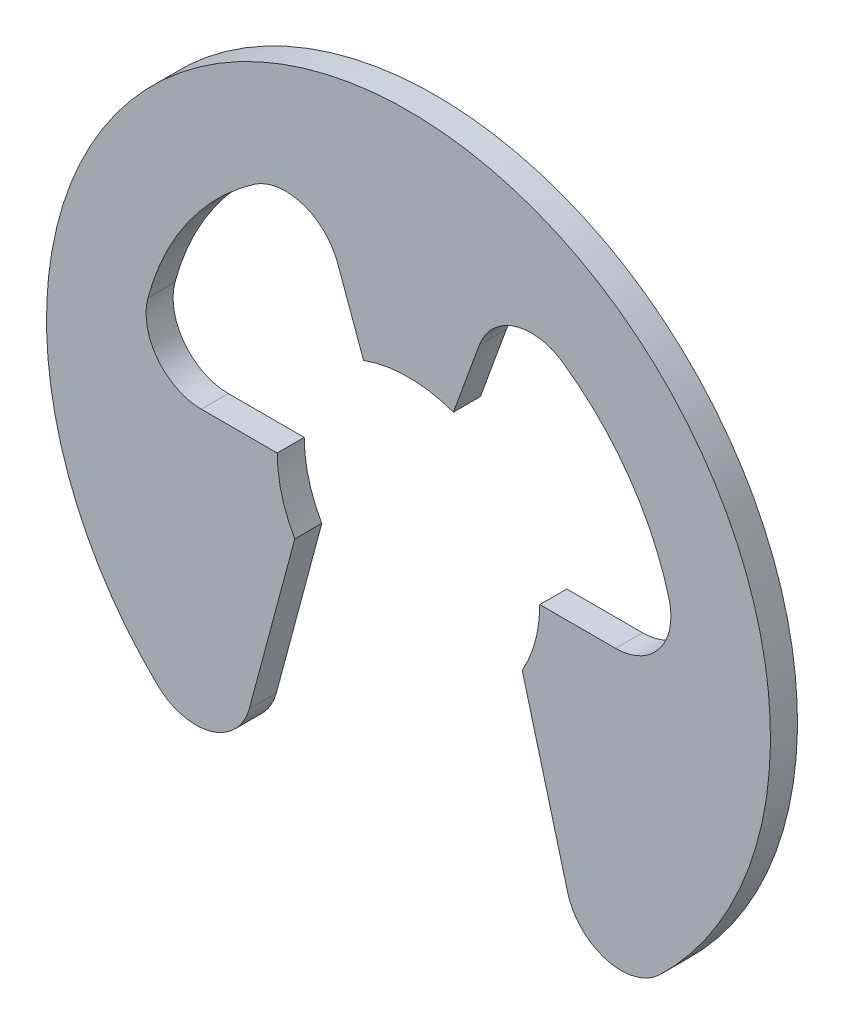
ISO-10303-21;
HEADER;
FILE_DESCRIPTION(('STEP AP214'),'2;1');
FILE_NAME('part.step','',(''),(''),'','','');
FILE_SCHEMA(('AUTOMOTIVE_DESIGN { 1 0 10303 214 1 1 1 1 }'));
ENDSEC;
DATA;
#1=APPLICATION_CONTEXT('core data for automotive mechanical design processes');
#2=APPLICATION_PROTOCOL_DEFINITION('international standard','automotive_design',2000,#1);
#3=PRODUCT_CONTEXT('',#1,'mechanical');
#4=PRODUCT('Part','Part','',(#3));
#5=PRODUCT_RELATED_PRODUCT_CATEGORY('part','',(#4));
#6=PRODUCT_DEFINITION_FORMATION('','',#4);
#7=PRODUCT_DEFINITION_CONTEXT('part definition',#1,'design');
#8=PRODUCT_DEFINITION('design','',#6,#7);
#9=PRODUCT_DEFINITION_SHAPE('','',#8);
#10=(LENGTH_UNIT() NAMED_UNIT(*) SI_UNIT(.MILLI.,.METRE.));
#11=(NAMED_UNIT(*) PLANE_ANGLE_UNIT() SI_UNIT($,.RADIAN.));
#12=(NAMED_UNIT(*) SI_UNIT($,.STERADIAN.) SOLID_ANGLE_UNIT());
#13=UNCERTAINTY_MEASURE_WITH_UNIT(LENGTH_MEASURE(1.E-05),#10,'distance_accuracy_value','');
#14=(GEOMETRIC_REPRESENTATION_CONTEXT(3) GLOBAL_UNCERTAINTY_ASSIGNED_CONTEXT((#13)) GLOBAL_UNIT_ASSIGNED_CONTEXT((#10,
#11,#12)) REPRESENTATION_CONTEXT('',''));
#15=CARTESIAN_POINT('',(0.,0.,0.));
#16=DIRECTION('',(0.,0.,1.));
#17=DIRECTION('',(1.,0.,0.));
#18=AXIS2_PLACEMENT_3D('',#15,#16,#17);
#19=CARTESIAN_POINT('',(0.,0.,0.));
#20=DIRECTION('',(0.,0.,1.));
#21=DIRECTION('',(1.,0.,0.));
#22=AXIS2_PLACEMENT_3D('',#19,#20,#21);
#23=PLANE('',#22);
#24=CARTESIAN_POINT('',(4.86734202869698,1.301496,0.));
#25=DIRECTION('',(0.,0.,1.));
#26=DIRECTION('',(1.,0.,0.));
#27=AXIS2_PLACEMENT_3D('',#24,#25,#26);
#28=CIRCLE('',#27,1.301496);
#29=CARTESIAN_POINT('',(6.12466510568041,1.63769611615245,0.));
#30=VERTEX_POINT('',#29);
#31=CARTESIAN_POINT('',(4.86734202869698,0.,0.));
#32=VERTEX_POINT('',#31);
#33=EDGE_CURVE('E164',#30,#32,#28,.F.);
#34=ORIENTED_EDGE('',*,*,#33,.T.);
#35=DIRECTION('',(-1.,0.,0.));
#36=VECTOR('',#35,1.);
#37=CARTESIAN_POINT('',(3.0861,0.,0.));
#38=LINE('',#37,#36);
#39=CARTESIAN_POINT('',(3.0861,0.,0.));
#40=VERTEX_POINT('',#39);
#41=EDGE_CURVE('E142',#40,#32,#38,.F.);
#42=ORIENTED_EDGE('',*,*,#41,.F.);
#43=CARTESIAN_POINT('',(0.,0.,0.));
#44=DIRECTION('',(0.,0.,1.));
#45=DIRECTION('',(1.,0.,0.));
#46=AXIS2_PLACEMENT_3D('',#43,#44,#45);
#47=CIRCLE('',#46,3.0861);
#48=CARTESIAN_POINT('',(2.67264099861915,-1.54305,0.));
#49=VERTEX_POINT('',#48);
#50=EDGE_CURVE('E17',#40,#49,#47,.F.);
#51=ORIENTED_EDGE('',*,*,#50,.T.);
#52=DIRECTION('',(0.258819045102523,-0.965925826289068,0.));
#53=VECTOR('',#52,1.);
#54=CARTESIAN_POINT('',(2.67264099861915,-1.54305,0.));
#55=LINE('',#54,#53);
#56=CARTESIAN_POINT('',(3.74090877619442,-5.52987962199954,0.));
#57=VERTEX_POINT('',#56);
#58=EDGE_CURVE('E140',#57,#49,#55,.F.);
#59=ORIENTED_EDGE('',*,*,#58,.F.);
#60=CARTESIAN_POINT('',(4.99805737540633,-5.19302767007479,0.));
#61=DIRECTION('',(0.,0.,1.));
#62=DIRECTION('',(1.,0.,0.));
#63=AXIS2_PLACEMENT_3D('',#60,#61,#62);
#64=CIRCLE('',#63,1.301496);
#65=CARTESIAN_POINT('',(5.90058225529011,-6.13075933702796,0.));
#66=VERTEX_POINT('',#65);
#67=EDGE_CURVE('E149',#66,#57,#64,.F.);
#68=ORIENTED_EDGE('',*,*,#67,.F.);
#69=CARTESIAN_POINT('',(0.,0.,0.));
#70=DIRECTION('',(0.,0.,1.));
#71=DIRECTION('',(1.,0.,0.));
#72=AXIS2_PLACEMENT_3D('',#69,#70,#71);
#73=CIRCLE('',#72,8.509);
#74=CARTESIAN_POINT('',(-5.90058225529011,-6.13075933702796,0.));
#75=VERTEX_POINT('',#74);
#76=EDGE_CURVE('E211',#75,#66,#73,.F.);
#77=ORIENTED_EDGE('',*,*,#76,.F.);
#78=CARTESIAN_POINT('',(-4.99805737540633,-5.19302767007479,0.));
#79=DIRECTION('',(0.,0.,1.));
#80=DIRECTION('',(1.,0.,0.));
#81=AXIS2_PLACEMENT_3D('',#78,#79,#80);
#82=CIRCLE('',#81,1.301496);
#83=CARTESIAN_POINT('',(-3.74090877619442,-5.52987962199954,0.));
#84=VERTEX_POINT('',#83);
#85=EDGE_CURVE('E208',#84,#75,#82,.F.);
#86=ORIENTED_EDGE('',*,*,#85,.F.);
#87=DIRECTION('',(0.258819045102522,0.965925826289068,0.));
#88=VECTOR('',#87,1.);
#89=CARTESIAN_POINT('',(-2.67264099861915,-1.54305,0.));
#90=LINE('',#89,#88);
#91=CARTESIAN_POINT('',(-2.67264099861915,-1.54305,0.));
#92=VERTEX_POINT('',#91);
#93=EDGE_CURVE('E204',#92,#84,#90,.F.);
#94=ORIENTED_EDGE('',*,*,#93,.F.);
#95=CARTESIAN_POINT('',(0.,0.,0.));
#96=DIRECTION('',(0.,0.,1.));
#97=DIRECTION('',(1.,0.,0.));
#98=AXIS2_PLACEMENT_3D('',#95,#96,#97);
#99=CIRCLE('',#98,3.0861);
#100=CARTESIAN_POINT('',(-3.0861,0.,0.));
#101=VERTEX_POINT('',#100);
#102=EDGE_CURVE('E201',#92,#101,#99,.F.);
#103=ORIENTED_EDGE('',*,*,#102,.T.);
#104=DIRECTION('',(-1.,0.,0.));
#105=VECTOR('',#104,1.);
#106=CARTESIAN_POINT('',(-3.0861,0.,0.));
#107=LINE('',#106,#105);
#108=CARTESIAN_POINT('',(-4.86734202869698,0.,0.));
#109=VERTEX_POINT('',#108);
#110=EDGE_CURVE('E197',#109,#101,#107,.F.);
#111=ORIENTED_EDGE('',*,*,#110,.F.);
#112=CARTESIAN_POINT('',(-4.86734202869698,1.301496,0.));
#113=DIRECTION('',(0.,0.,1.));
#114=DIRECTION('',(1.,0.,0.));
#115=AXIS2_PLACEMENT_3D('',#112,#113,#114);
#116=CIRCLE('',#115,1.301496);
#117=CARTESIAN_POINT('',(-6.12466510568041,1.63769611615245,0.));
#118=VERTEX_POINT('',#117);
#119=EDGE_CURVE('E191',#109,#118,#116,.F.);
#120=ORIENTED_EDGE('',*,*,#119,.T.);
#121=CARTESIAN_POINT('',(0.,0.,0.));
#122=DIRECTION('',(0.,0.,1.));
#123=DIRECTION('',(1.,0.,0.));
#124=AXIS2_PLACEMENT_3D('',#121,#122,#123);
#125=CIRCLE('',#124,6.33984);
#126=CARTESIAN_POINT('',(-3.63368979270474,5.19517754422247,0.));
#127=VERTEX_POINT('',#126);
#128=EDGE_CURVE('E187',#118,#127,#125,.F.);
#129=ORIENTED_EDGE('',*,*,#128,.T.);
#130=CARTESIAN_POINT('',(-2.88773520545237,4.12866753874987,0.));
#131=DIRECTION('',(0.,0.,1.));
#132=DIRECTION('',(1.,0.,0.));
#133=AXIS2_PLACEMENT_3D('',#130,#131,#132);
#134=CIRCLE('',#133,1.301496);
#135=CARTESIAN_POINT('',(-1.66472901827,4.57380538720766,0.));
#136=VERTEX_POINT('',#135);
#137=EDGE_CURVE('E186',#127,#136,#134,.F.);
#138=ORIENTED_EDGE('',*,*,#137,.T.);
#139=DIRECTION('',(0.34202014332567,-0.939692620785908,0.));
#140=VECTOR('',#139,1.);
#141=CARTESIAN_POINT('',(-1.05550836431735,2.89998539700739,0.));
#142=LINE('',#141,#140);
#143=CARTESIAN_POINT('',(-1.05550836431735,2.89998539700739,0.));
#144=VERTEX_POINT('',#143);
#145=EDGE_CURVE('E182',#144,#136,#142,.F.);
#146=ORIENTED_EDGE('',*,*,#145,.F.);
#147=CARTESIAN_POINT('',(0.,0.,0.));
#148=DIRECTION('',(0.,0.,1.));
#149=DIRECTION('',(1.,0.,0.));
#150=AXIS2_PLACEMENT_3D('',#147,#148,#149);
#151=CIRCLE('',#150,3.0861);
#152=CARTESIAN_POINT('',(1.05550836431735,2.89998539700739,0.));
#153=VERTEX_POINT('',#152);
#154=EDGE_CURVE('E179',#144,#153,#151,.F.);
#155=ORIENTED_EDGE('',*,*,#154,.T.);
#156=DIRECTION('',(0.34202014332567,0.939692620785908,0.));
#157=VECTOR('',#156,1.);
#158=CARTESIAN_POINT('',(1.05550836431735,2.89998539700739,0.));
#159=LINE('',#158,#157);
#160=CARTESIAN_POINT('',(1.66472901827,4.57380538720766,0.));
#161=VERTEX_POINT('',#160);
#162=EDGE_CURVE('E175',#161,#153,#159,.F.);
#163=ORIENTED_EDGE('',*,*,#162,.F.);
#164=CARTESIAN_POINT('',(2.88773520545237,4.12866753874987,0.));
#165=DIRECTION('',(0.,0.,1.));
#166=DIRECTION('',(1.,0.,0.));
#167=AXIS2_PLACEMENT_3D('',#164,#165,#166);
#168=CIRCLE('',#167,1.301496);
#169=CARTESIAN_POINT('',(3.63368979270474,5.19517754422247,0.));
#170=VERTEX_POINT('',#169);
#171=EDGE_CURVE('E169',#161,#170,#168,.F.);
#172=ORIENTED_EDGE('',*,*,#171,.T.);
#173=CARTESIAN_POINT('',(0.,0.,0.));
#174=DIRECTION('',(0.,0.,1.));
#175=DIRECTION('',(1.,0.,0.));
#176=AXIS2_PLACEMENT_3D('',#173,#174,#175);
#177=CIRCLE('',#176,6.33984);
#178=EDGE_CURVE('E165',#170,#30,#177,.F.);
#179=ORIENTED_EDGE('',*,*,#178,.T.);
#180=EDGE_LOOP('',(#34,#42,#51,#59,#68,#77,#86,#94,#103,#111,#120,#129,#138,#146,#155,#163,#172,#179));
#181=FACE_BOUND('',#180,.T.);
#182=ADVANCED_FACE('F14',(#181),#23,.T.);
#183=CARTESIAN_POINT('',(2.67264099861915,-1.54305,-0.635));
#184=DIRECTION('',(-0.965925826289068,-0.258819045102523,0.));
#185=DIRECTION('',(0.258819045102523,-0.965925826289068,0.));
#186=AXIS2_PLACEMENT_3D('',#183,#184,#185);
#187=PLANE('',#186);
#188=DIRECTION('',(0.258819045102522,-0.965925826289068,0.));
#189=VECTOR('',#188,1.);
#190=CARTESIAN_POINT('',(2.67264099861915,-1.54305,-0.635));
#191=LINE('',#190,#189);
#192=CARTESIAN_POINT('',(2.67264099861915,-1.54305,-0.635));
#193=VERTEX_POINT('',#192);
#194=CARTESIAN_POINT('',(3.74090877619442,-5.52987962199954,-0.635));
#195=VERTEX_POINT('',#194);
#196=EDGE_CURVE('E154',#193,#195,#191,.T.);
#197=ORIENTED_EDGE('',*,*,#196,.T.);
#198=DIRECTION('',(0.,0.,1.));
#199=VECTOR('',#198,1.);
#200=CARTESIAN_POINT('',(3.74090877619442,-5.52987962199954,-0.635));
#201=LINE('',#200,#199);
#202=EDGE_CURVE('E148',#57,#195,#201,.F.);
#203=ORIENTED_EDGE('',*,*,#202,.F.);
#204=ORIENTED_EDGE('',*,*,#58,.T.);
#205=DIRECTION('',(0.,0.,1.));
#206=VECTOR('',#205,1.);
#207=CARTESIAN_POINT('',(2.67264099861915,-1.54305,-0.635));
#208=LINE('',#207,#206);
#209=EDGE_CURVE('E147',#49,#193,#208,.F.);
#210=ORIENTED_EDGE('',*,*,#209,.T.);
#211=EDGE_LOOP('',(#197,#203,#204,#210));
#212=FACE_BOUND('',#211,.T.);
#213=ADVANCED_FACE('F146',(#212),#187,.T.);
#214=CARTESIAN_POINT('',(4.99805737540633,-5.19302767007479,-0.635));
#215=DIRECTION('',(0.,0.,1.));
#216=DIRECTION('',(1.,0.,0.));
#217=AXIS2_PLACEMENT_3D('',#214,#215,#216);
#218=CYLINDRICAL_SURFACE('',#217,1.301496);
#219=CARTESIAN_POINT('',(4.99805737540633,-5.19302767007479,-0.635));
#220=DIRECTION('',(0.,0.,1.));
#221=DIRECTION('',(1.,0.,0.));
#222=AXIS2_PLACEMENT_3D('',#219,#220,#221);
#223=CIRCLE('',#222,1.301496);
#224=CARTESIAN_POINT('',(5.90058225529011,-6.13075933702796,-0.635));
#225=VERTEX_POINT('',#224);
#226=EDGE_CURVE('E250',#195,#225,#223,.T.);
#227=ORIENTED_EDGE('',*,*,#226,.T.);
#228=DIRECTION('',(0.,0.,1.));
#229=VECTOR('',#228,1.);
#230=CARTESIAN_POINT('',(5.90058225529011,-6.13075933702796,-0.635));
#231=LINE('',#230,#229);
#232=EDGE_CURVE('E209',#66,#225,#231,.F.);
#233=ORIENTED_EDGE('',*,*,#232,.F.);
#234=ORIENTED_EDGE('',*,*,#67,.T.);
#235=ORIENTED_EDGE('',*,*,#202,.T.);
#236=EDGE_LOOP('',(#227,#233,#234,#235));
#237=FACE_BOUND('',#236,.T.);
#238=ADVANCED_FACE('F268',(#237),#218,.T.);
#239=CARTESIAN_POINT('',(0.,0.,-0.635));
#240=DIRECTION('',(0.,0.,1.));
#241=DIRECTION('',(1.,0.,0.));
#242=AXIS2_PLACEMENT_3D('',#239,#240,#241);
#243=CYLINDRICAL_SURFACE('',#242,8.509);
#244=DIRECTION('',(0.,0.,1.));
#245=VECTOR('',#244,1.);
#246=CARTESIAN_POINT('',(-5.90058225529011,-6.13075933702796,-0.635));
#247=LINE('',#246,#245);
#248=CARTESIAN_POINT('',(-5.90058225529011,-6.13075933702796,-0.635));
#249=VERTEX_POINT('',#248);
#250=EDGE_CURVE('E205',#75,#249,#247,.F.);
#251=ORIENTED_EDGE('',*,*,#250,.F.);
#252=ORIENTED_EDGE('',*,*,#76,.T.);
#253=ORIENTED_EDGE('',*,*,#232,.T.);
#254=CARTESIAN_POINT('',(0.,0.,-0.635));
#255=DIRECTION('',(0.,0.,1.));
#256=DIRECTION('',(1.,0.,0.));
#257=AXIS2_PLACEMENT_3D('',#254,#255,#256);
#258=CIRCLE('',#257,8.509);
#259=EDGE_CURVE('E248',#225,#249,#258,.T.);
#260=ORIENTED_EDGE('',*,*,#259,.T.);
#261=EDGE_LOOP('',(#251,#252,#253,#260));
#262=FACE_BOUND('',#261,.T.);
#263=ADVANCED_FACE('F275',(#262),#243,.T.);
#264=CARTESIAN_POINT('',(-4.99805737540633,-5.19302767007479,-0.635));
#265=DIRECTION('',(0.,0.,1.));
#266=DIRECTION('',(1.,0.,0.));
#267=AXIS2_PLACEMENT_3D('',#264,#265,#266);
#268=CYLINDRICAL_SURFACE('',#267,1.301496);
#269=CARTESIAN_POINT('',(-4.99805737540633,-5.19302767007479,-0.635));
#270=DIRECTION('',(0.,0.,1.));
#271=DIRECTION('',(1.,0.,0.));
#272=AXIS2_PLACEMENT_3D('',#269,#270,#271);
#273=CIRCLE('',#272,1.301496);
#274=CARTESIAN_POINT('',(-3.74090877619442,-5.52987962199954,-0.635));
#275=VERTEX_POINT('',#274);
#276=EDGE_CURVE('E245',#249,#275,#273,.T.);
#277=ORIENTED_EDGE('',*,*,#276,.T.);
#278=DIRECTION('',(0.,0.,1.));
#279=VECTOR('',#278,1.);
#280=CARTESIAN_POINT('',(-3.74090877619442,-5.52987962199954,-0.635));
#281=LINE('',#280,#279);
#282=EDGE_CURVE('E202',#84,#275,#281,.F.);
#283=ORIENTED_EDGE('',*,*,#282,.F.);
#284=ORIENTED_EDGE('',*,*,#85,.T.);
#285=ORIENTED_EDGE('',*,*,#250,.T.);
#286=EDGE_LOOP('',(#277,#283,#284,#285));
#287=FACE_BOUND('',#286,.T.);
#288=ADVANCED_FACE('F279',(#287),#268,.T.);
#289=CARTESIAN_POINT('',(-2.67264099861915,-1.54305,-0.635));
#290=DIRECTION('',(0.965925826289068,-0.258819045102522,0.));
#291=DIRECTION('',(0.258819045102522,0.965925826289068,0.));
#292=AXIS2_PLACEMENT_3D('',#289,#290,#291);
#293=PLANE('',#292);
#294=DIRECTION('',(0.258819045102522,0.965925826289068,0.));
#295=VECTOR('',#294,1.);
#296=CARTESIAN_POINT('',(-3.74090877619442,-5.52987962199954,-0.635));
#297=LINE('',#296,#295);
#298=CARTESIAN_POINT('',(-2.67264099861915,-1.54305,-0.635));
#299=VERTEX_POINT('',#298);
#300=EDGE_CURVE('E244',#275,#299,#297,.T.);
#301=ORIENTED_EDGE('',*,*,#300,.T.);
#302=DIRECTION('',(0.,0.,1.));
#303=VECTOR('',#302,1.);
#304=CARTESIAN_POINT('',(-2.67264099861915,-1.54305,-0.635));
#305=LINE('',#304,#303);
#306=EDGE_CURVE('E198',#299,#92,#305,.T.);
#307=ORIENTED_EDGE('',*,*,#306,.T.);
#308=ORIENTED_EDGE('',*,*,#93,.T.);
#309=ORIENTED_EDGE('',*,*,#282,.T.);
#310=EDGE_LOOP('',(#301,#307,#308,#309));
#311=FACE_BOUND('',#310,.T.);
#312=ADVANCED_FACE('F339',(#311),#293,.T.);
#313=CARTESIAN_POINT('',(0.,0.,-0.635));
#314=DIRECTION('',(0.,0.,1.));
#315=DIRECTION('',(1.,0.,0.));
#316=AXIS2_PLACEMENT_3D('',#313,#314,#315);
#317=CYLINDRICAL_SURFACE('',#316,3.0861);
#318=ORIENTED_EDGE('',*,*,#306,.F.);
#319=CARTESIAN_POINT('',(0.,0.,-0.635));
#320=DIRECTION('',(0.,0.,1.));
#321=DIRECTION('',(1.,0.,0.));
#322=AXIS2_PLACEMENT_3D('',#319,#320,#321);
#323=CIRCLE('',#322,3.0861);
#324=CARTESIAN_POINT('',(-3.0861,0.,-0.635));
#325=VERTEX_POINT('',#324);
#326=EDGE_CURVE('E241',#299,#325,#323,.F.);
#327=ORIENTED_EDGE('',*,*,#326,.T.);
#328=DIRECTION('',(0.,0.,1.));
#329=VECTOR('',#328,1.);
#330=CARTESIAN_POINT('',(-3.0861,0.,-0.635));
#331=LINE('',#330,#329);
#332=EDGE_CURVE('E195',#101,#325,#331,.F.);
#333=ORIENTED_EDGE('',*,*,#332,.F.);
#334=ORIENTED_EDGE('',*,*,#102,.F.);
#335=EDGE_LOOP('',(#318,#327,#333,#334));
#336=FACE_BOUND('',#335,.T.);
#337=ADVANCED_FACE('F338',(#336),#317,.F.);
#338=CARTESIAN_POINT('',(-3.0861,0.,-0.635));
#339=DIRECTION('',(0.,1.,0.));
#340=DIRECTION('',(-1.,0.,0.));
#341=AXIS2_PLACEMENT_3D('',#338,#339,#340);
#342=PLANE('',#341);
#343=DIRECTION('',(1.,0.,0.));
#344=VECTOR('',#343,1.);
#345=CARTESIAN_POINT('',(0.,0.,-0.635));
#346=LINE('',#345,#344);
#347=CARTESIAN_POINT('',(-4.86734202869698,0.,-0.635));
#348=VERTEX_POINT('',#347);
#349=EDGE_CURVE('E240',#325,#348,#346,.F.);
#350=ORIENTED_EDGE('',*,*,#349,.T.);
#351=DIRECTION('',(0.,0.,1.));
#352=VECTOR('',#351,1.);
#353=CARTESIAN_POINT('',(-4.86734202869698,0.,-0.635));
#354=LINE('',#353,#352);
#355=EDGE_CURVE('E192',#348,#109,#354,.T.);
#356=ORIENTED_EDGE('',*,*,#355,.T.);
#357=ORIENTED_EDGE('',*,*,#110,.T.);
#358=ORIENTED_EDGE('',*,*,#332,.T.);
#359=EDGE_LOOP('',(#350,#356,#357,#358));
#360=FACE_BOUND('',#359,.T.);
#361=ADVANCED_FACE('F334',(#360),#342,.T.);
#362=CARTESIAN_POINT('',(-4.86734202869698,1.301496,-0.635));
#363=DIRECTION('',(0.,0.,1.));
#364=DIRECTION('',(1.,0.,0.));
#365=AXIS2_PLACEMENT_3D('',#362,#363,#364);
#366=CYLINDRICAL_SURFACE('',#365,1.301496);
#367=ORIENTED_EDGE('',*,*,#355,.F.);
#368=CARTESIAN_POINT('',(-4.86734202869698,1.301496,-0.635));
#369=DIRECTION('',(0.,0.,1.));
#370=DIRECTION('',(1.,0.,0.));
#371=AXIS2_PLACEMENT_3D('',#368,#369,#370);
#372=CIRCLE('',#371,1.301496);
#373=CARTESIAN_POINT('',(-6.12466510568041,1.63769611615245,-0.635));
#374=VERTEX_POINT('',#373);
#375=EDGE_CURVE('E237',#348,#374,#372,.F.);
#376=ORIENTED_EDGE('',*,*,#375,.T.);
#377=DIRECTION('',(0.,0.,1.));
#378=VECTOR('',#377,1.);
#379=CARTESIAN_POINT('',(-6.12466510568041,1.63769611615245,-0.635));
#380=LINE('',#379,#378);
#381=EDGE_CURVE('E188',#374,#118,#380,.T.);
#382=ORIENTED_EDGE('',*,*,#381,.T.);
#383=ORIENTED_EDGE('',*,*,#119,.F.);
#384=EDGE_LOOP('',(#367,#376,#382,#383));
#385=FACE_BOUND('',#384,.T.);
#386=ADVANCED_FACE('F332',(#385),#366,.F.);
#387=CARTESIAN_POINT('',(0.,0.,-0.635));
#388=DIRECTION('',(0.,0.,1.));
#389=DIRECTION('',(1.,0.,0.));
#390=AXIS2_PLACEMENT_3D('',#387,#388,#389);
#391=CYLINDRICAL_SURFACE('',#390,6.33984);
#392=ORIENTED_EDGE('',*,*,#381,.F.);
#393=CARTESIAN_POINT('',(0.,0.,-0.635));
#394=DIRECTION('',(0.,0.,1.));
#395=DIRECTION('',(1.,0.,0.));
#396=AXIS2_PLACEMENT_3D('',#393,#394,#395);
#397=CIRCLE('',#396,6.33984);
#398=CARTESIAN_POINT('',(-3.63368979270474,5.19517754422247,-0.635));
#399=VERTEX_POINT('',#398);
#400=EDGE_CURVE('E234',#374,#399,#397,.F.);
#401=ORIENTED_EDGE('',*,*,#400,.T.);
#402=DIRECTION('',(0.,0.,1.));
#403=VECTOR('',#402,1.);
#404=CARTESIAN_POINT('',(-3.63368979270474,5.19517754422247,-0.635));
#405=LINE('',#404,#403);
#406=EDGE_CURVE('E183',#399,#127,#405,.T.);
#407=ORIENTED_EDGE('',*,*,#406,.T.);
#408=ORIENTED_EDGE('',*,*,#128,.F.);
#409=EDGE_LOOP('',(#392,#401,#407,#408));
#410=FACE_BOUND('',#409,.T.);
#411=ADVANCED_FACE('F328',(#410),#391,.F.);
#412=CARTESIAN_POINT('',(-2.88773520545237,4.12866753874987,-0.635));
#413=DIRECTION('',(0.,0.,1.));
#414=DIRECTION('',(1.,0.,0.));
#415=AXIS2_PLACEMENT_3D('',#412,#413,#414);
#416=CYLINDRICAL_SURFACE('',#415,1.301496);
#417=ORIENTED_EDGE('',*,*,#406,.F.);
#418=CARTESIAN_POINT('',(-2.88773520545237,4.12866753874987,-0.635));
#419=DIRECTION('',(0.,0.,1.));
#420=DIRECTION('',(1.,0.,0.));
#421=AXIS2_PLACEMENT_3D('',#418,#419,#420);
#422=CIRCLE('',#421,1.301496);
#423=CARTESIAN_POINT('',(-1.66472901827,4.57380538720766,-0.635));
#424=VERTEX_POINT('',#423);
#425=EDGE_CURVE('E231',#399,#424,#422,.F.);
#426=ORIENTED_EDGE('',*,*,#425,.T.);
#427=DIRECTION('',(0.,0.,1.));
#428=VECTOR('',#427,1.);
#429=CARTESIAN_POINT('',(-1.66472901827,4.57380538720766,-0.635));
#430=LINE('',#429,#428);
#431=EDGE_CURVE('E180',#136,#424,#430,.F.);
#432=ORIENTED_EDGE('',*,*,#431,.F.);
#433=ORIENTED_EDGE('',*,*,#137,.F.);
#434=EDGE_LOOP('',(#417,#426,#432,#433));
#435=FACE_BOUND('',#434,.T.);
#436=ADVANCED_FACE('F324',(#435),#416,.F.);
#437=CARTESIAN_POINT('',(-1.05550836431735,2.89998539700739,-0.635));
#438=DIRECTION('',(-0.939692620785908,-0.34202014332567,0.));
#439=DIRECTION('',(0.34202014332567,-0.939692620785908,0.));
#440=AXIS2_PLACEMENT_3D('',#437,#438,#439);
#441=PLANE('',#440);
#442=DIRECTION('',(0.34202014332567,-0.939692620785908,0.));
#443=VECTOR('',#442,1.);
#444=CARTESIAN_POINT('',(-1.66472901827,4.57380538720766,-0.635));
#445=LINE('',#444,#443);
#446=CARTESIAN_POINT('',(-1.05550836431735,2.89998539700739,-0.635));
#447=VERTEX_POINT('',#446);
#448=EDGE_CURVE('E230',#424,#447,#445,.T.);
#449=ORIENTED_EDGE('',*,*,#448,.T.);
#450=DIRECTION('',(0.,0.,1.));
#451=VECTOR('',#450,1.);
#452=CARTESIAN_POINT('',(-1.05550836431735,2.89998539700739,-0.635));
#453=LINE('',#452,#451);
#454=EDGE_CURVE('E176',#447,#144,#453,.T.);
#455=ORIENTED_EDGE('',*,*,#454,.T.);
#456=ORIENTED_EDGE('',*,*,#145,.T.);
#457=ORIENTED_EDGE('',*,*,#431,.T.);
#458=EDGE_LOOP('',(#449,#455,#456,#457));
#459=FACE_BOUND('',#458,.T.);
#460=ADVANCED_FACE('F320',(#459),#441,.T.);
#461=CARTESIAN_POINT('',(0.,0.,-0.635));
#462=DIRECTION('',(0.,0.,1.));
#463=DIRECTION('',(1.,0.,0.));
#464=AXIS2_PLACEMENT_3D('',#461,#462,#463);
#465=CYLINDRICAL_SURFACE('',#464,3.0861);
#466=ORIENTED_EDGE('',*,*,#454,.F.);
#467=CARTESIAN_POINT('',(0.,0.,-0.635));
#468=DIRECTION('',(0.,0.,1.));
#469=DIRECTION('',(1.,0.,0.));
#470=AXIS2_PLACEMENT_3D('',#467,#468,#469);
#471=CIRCLE('',#470,3.0861);
#472=CARTESIAN_POINT('',(1.05550836431735,2.89998539700739,-0.635));
#473=VERTEX_POINT('',#472);
#474=EDGE_CURVE('E227',#447,#473,#471,.F.);
#475=ORIENTED_EDGE('',*,*,#474,.T.);
#476=DIRECTION('',(0.,0.,1.));
#477=VECTOR('',#476,1.);
#478=CARTESIAN_POINT('',(1.05550836431735,2.89998539700739,-0.635));
#479=LINE('',#478,#477);
#480=EDGE_CURVE('E173',#153,#473,#479,.F.);
#481=ORIENTED_EDGE('',*,*,#480,.F.);
#482=ORIENTED_EDGE('',*,*,#154,.F.);
#483=EDGE_LOOP('',(#466,#475,#481,#482));
#484=FACE_BOUND('',#483,.T.);
#485=ADVANCED_FACE('F316',(#484),#465,.F.);
#486=CARTESIAN_POINT('',(1.05550836431735,2.89998539700739,-0.635));
#487=DIRECTION('',(0.939692620785908,-0.34202014332567,0.));
#488=DIRECTION('',(0.34202014332567,0.939692620785908,0.));
#489=AXIS2_PLACEMENT_3D('',#486,#487,#488);
#490=PLANE('',#489);
#491=DIRECTION('',(0.34202014332567,0.939692620785908,0.));
#492=VECTOR('',#491,1.);
#493=CARTESIAN_POINT('',(1.05550836431735,2.89998539700739,-0.635));
#494=LINE('',#493,#492);
#495=CARTESIAN_POINT('',(1.66472901827,4.57380538720766,-0.635));
#496=VERTEX_POINT('',#495);
#497=EDGE_CURVE('E226',#473,#496,#494,.T.);
#498=ORIENTED_EDGE('',*,*,#497,.T.);
#499=DIRECTION('',(0.,0.,1.));
#500=VECTOR('',#499,1.);
#501=CARTESIAN_POINT('',(1.66472901827,4.57380538720766,-0.635));
#502=LINE('',#501,#500);
#503=EDGE_CURVE('E170',#496,#161,#502,.T.);
#504=ORIENTED_EDGE('',*,*,#503,.T.);
#505=ORIENTED_EDGE('',*,*,#162,.T.);
#506=ORIENTED_EDGE('',*,*,#480,.T.);
#507=EDGE_LOOP('',(#498,#504,#505,#506));
#508=FACE_BOUND('',#507,.T.);
#509=ADVANCED_FACE('F312',(#508),#490,.T.);
#510=CARTESIAN_POINT('',(2.88773520545237,4.12866753874987,-0.635));
#511=DIRECTION('',(0.,0.,1.));
#512=DIRECTION('',(1.,0.,0.));
#513=AXIS2_PLACEMENT_3D('',#510,#511,#512);
#514=CYLINDRICAL_SURFACE('',#513,1.301496);
#515=ORIENTED_EDGE('',*,*,#503,.F.);
#516=CARTESIAN_POINT('',(2.88773520545237,4.12866753874987,-0.635));
#517=DIRECTION('',(0.,0.,1.));
#518=DIRECTION('',(1.,0.,0.));
#519=AXIS2_PLACEMENT_3D('',#516,#517,#518);
#520=CIRCLE('',#519,1.301496);
#521=CARTESIAN_POINT('',(3.63368979270474,5.19517754422247,-0.635));
#522=VERTEX_POINT('',#521);
#523=EDGE_CURVE('E223',#496,#522,#520,.F.);
#524=ORIENTED_EDGE('',*,*,#523,.T.);
#525=DIRECTION('',(0.,0.,1.));
#526=VECTOR('',#525,1.);
#527=CARTESIAN_POINT('',(3.63368979270474,5.19517754422247,-0.635));
#528=LINE('',#527,#526);
#529=EDGE_CURVE('E166',#522,#170,#528,.T.);
#530=ORIENTED_EDGE('',*,*,#529,.T.);
#531=ORIENTED_EDGE('',*,*,#171,.F.);
#532=EDGE_LOOP('',(#515,#524,#530,#531));
#533=FACE_BOUND('',#532,.T.);
#534=ADVANCED_FACE('F308',(#533),#514,.F.);
#535=CARTESIAN_POINT('',(0.,0.,-0.635));
#536=DIRECTION('',(0.,0.,1.));
#537=DIRECTION('',(1.,0.,0.));
#538=AXIS2_PLACEMENT_3D('',#535,#536,#537);
#539=CYLINDRICAL_SURFACE('',#538,6.33984);
#540=ORIENTED_EDGE('',*,*,#529,.F.);
#541=CARTESIAN_POINT('',(0.,0.,-0.635));
#542=DIRECTION('',(0.,0.,1.));
#543=DIRECTION('',(1.,0.,0.));
#544=AXIS2_PLACEMENT_3D('',#541,#542,#543);
#545=CIRCLE('',#544,6.33984);
#546=CARTESIAN_POINT('',(6.12466510568041,1.63769611615245,-0.635));
#547=VERTEX_POINT('',#546);
#548=EDGE_CURVE('E220',#522,#547,#545,.F.);
#549=ORIENTED_EDGE('',*,*,#548,.T.);
#550=DIRECTION('',(0.,0.,1.));
#551=VECTOR('',#550,1.);
#552=CARTESIAN_POINT('',(6.12466510568041,1.63769611615245,-0.635));
#553=LINE('',#552,#551);
#554=EDGE_CURVE('E161',#547,#30,#553,.T.);
#555=ORIENTED_EDGE('',*,*,#554,.T.);
#556=ORIENTED_EDGE('',*,*,#178,.F.);
#557=EDGE_LOOP('',(#540,#549,#555,#556));
#558=FACE_BOUND('',#557,.T.);
#559=ADVANCED_FACE('F304',(#558),#539,.F.);
#560=CARTESIAN_POINT('',(4.86734202869698,1.301496,-0.635));
#561=DIRECTION('',(0.,0.,1.));
#562=DIRECTION('',(1.,0.,0.));
#563=AXIS2_PLACEMENT_3D('',#560,#561,#562);
#564=CYLINDRICAL_SURFACE('',#563,1.301496);
#565=CARTESIAN_POINT('',(4.86734202869698,1.301496,-0.635));
#566=DIRECTION('',(0.,0.,1.));
#567=DIRECTION('',(1.,0.,0.));
#568=AXIS2_PLACEMENT_3D('',#565,#566,#567);
#569=CIRCLE('',#568,1.301496);
#570=CARTESIAN_POINT('',(4.86734202869698,0.,-0.635));
#571=VERTEX_POINT('',#570);
#572=EDGE_CURVE('E218',#547,#571,#569,.F.);
#573=ORIENTED_EDGE('',*,*,#572,.T.);
#574=DIRECTION('',(0.,0.,1.));
#575=VECTOR('',#574,1.);
#576=CARTESIAN_POINT('',(4.86734202869698,0.,-0.635));
#577=LINE('',#576,#575);
#578=EDGE_CURVE('E152',#32,#571,#577,.F.);
#579=ORIENTED_EDGE('',*,*,#578,.F.);
#580=ORIENTED_EDGE('',*,*,#33,.F.);
#581=ORIENTED_EDGE('',*,*,#554,.F.);
#582=EDGE_LOOP('',(#573,#579,#580,#581));
#583=FACE_BOUND('',#582,.T.);
#584=ADVANCED_FACE('F340',(#583),#564,.F.);
#585=CARTESIAN_POINT('',(3.0861,0.,-0.635));
#586=DIRECTION('',(0.,1.,0.));
#587=DIRECTION('',(-1.,0.,0.));
#588=AXIS2_PLACEMENT_3D('',#585,#586,#587);
#589=PLANE('',#588);
#590=DIRECTION('',(1.,0.,0.));
#591=VECTOR('',#590,1.);
#592=CARTESIAN_POINT('',(0.,0.,-0.635));
#593=LINE('',#592,#591);
#594=CARTESIAN_POINT('',(3.0861,0.,-0.635));
#595=VERTEX_POINT('',#594);
#596=EDGE_CURVE('E23',#571,#595,#593,.F.);
#597=ORIENTED_EDGE('',*,*,#596,.T.);
#598=DIRECTION('',(0.,0.,1.));
#599=VECTOR('',#598,1.);
#600=CARTESIAN_POINT('',(3.0861,0.,-0.635));
#601=LINE('',#600,#599);
#602=EDGE_CURVE('E31',#595,#40,#601,.T.);
#603=ORIENTED_EDGE('',*,*,#602,.T.);
#604=ORIENTED_EDGE('',*,*,#41,.T.);
#605=ORIENTED_EDGE('',*,*,#578,.T.);
#606=EDGE_LOOP('',(#597,#603,#604,#605));
#607=FACE_BOUND('',#606,.T.);
#608=ADVANCED_FACE('F297',(#607),#589,.T.);
#609=CARTESIAN_POINT('',(0.,0.,-0.635));
#610=DIRECTION('',(0.,0.,1.));
#611=DIRECTION('',(1.,0.,0.));
#612=AXIS2_PLACEMENT_3D('',#609,#610,#611);
#613=CYLINDRICAL_SURFACE('',#612,3.0861);
#614=ORIENTED_EDGE('',*,*,#602,.F.);
#615=CARTESIAN_POINT('',(0.,0.,-0.635));
#616=DIRECTION('',(0.,0.,1.));
#617=DIRECTION('',(1.,0.,0.));
#618=AXIS2_PLACEMENT_3D('',#615,#616,#617);
#619=CIRCLE('',#618,3.0861);
#620=EDGE_CURVE('E9',#595,#193,#619,.F.);
#621=ORIENTED_EDGE('',*,*,#620,.T.);
#622=ORIENTED_EDGE('',*,*,#209,.F.);
#623=ORIENTED_EDGE('',*,*,#50,.F.);
#624=EDGE_LOOP('',(#614,#621,#622,#623));
#625=FACE_BOUND('',#624,.T.);
#626=ADVANCED_FACE('F151',(#625),#613,.F.);
#627=CARTESIAN_POINT('',(0.,0.,-0.635));
#628=DIRECTION('',(0.,0.,1.));
#629=DIRECTION('',(1.,0.,0.));
#630=AXIS2_PLACEMENT_3D('',#627,#628,#629);
#631=PLANE('',#630);
#632=ORIENTED_EDGE('',*,*,#596,.F.);
#633=ORIENTED_EDGE('',*,*,#572,.F.);
#634=ORIENTED_EDGE('',*,*,#548,.F.);
#635=ORIENTED_EDGE('',*,*,#523,.F.);
#636=ORIENTED_EDGE('',*,*,#497,.F.);
#637=ORIENTED_EDGE('',*,*,#474,.F.);
#638=ORIENTED_EDGE('',*,*,#448,.F.);
#639=ORIENTED_EDGE('',*,*,#425,.F.);
#640=ORIENTED_EDGE('',*,*,#400,.F.);
#641=ORIENTED_EDGE('',*,*,#375,.F.);
#642=ORIENTED_EDGE('',*,*,#349,.F.);
#643=ORIENTED_EDGE('',*,*,#326,.F.);
#644=ORIENTED_EDGE('',*,*,#300,.F.);
#645=ORIENTED_EDGE('',*,*,#276,.F.);
#646=ORIENTED_EDGE('',*,*,#259,.F.);
#647=ORIENTED_EDGE('',*,*,#226,.F.);
#648=ORIENTED_EDGE('',*,*,#196,.F.);
#649=ORIENTED_EDGE('',*,*,#620,.F.);
#650=EDGE_LOOP('',(#632,#633,#634,#635,#636,#637,#638,#639,#640,#641,#642,#643,#644,#645,#646,
#647,#648,#649));
#651=FACE_BOUND('',#650,.T.);
#652=ADVANCED_FACE('F283',(#651),#631,.F.);
#653=CLOSED_SHELL('',(#182,#213,#238,#263,#288,#312,#337,#361,#386,#411,#436,#460,#485,#509,
#534,#559,#584,#608,#626,#652));
#654=MANIFOLD_SOLID_BREP('B1',#653);
#655=ADVANCED_BREP_SHAPE_REPRESENTATION('',(#18,#654),#14);
#656=SHAPE_DEFINITION_REPRESENTATION(#9,#655);
ENDSEC;
END-ISO-10303-21;
